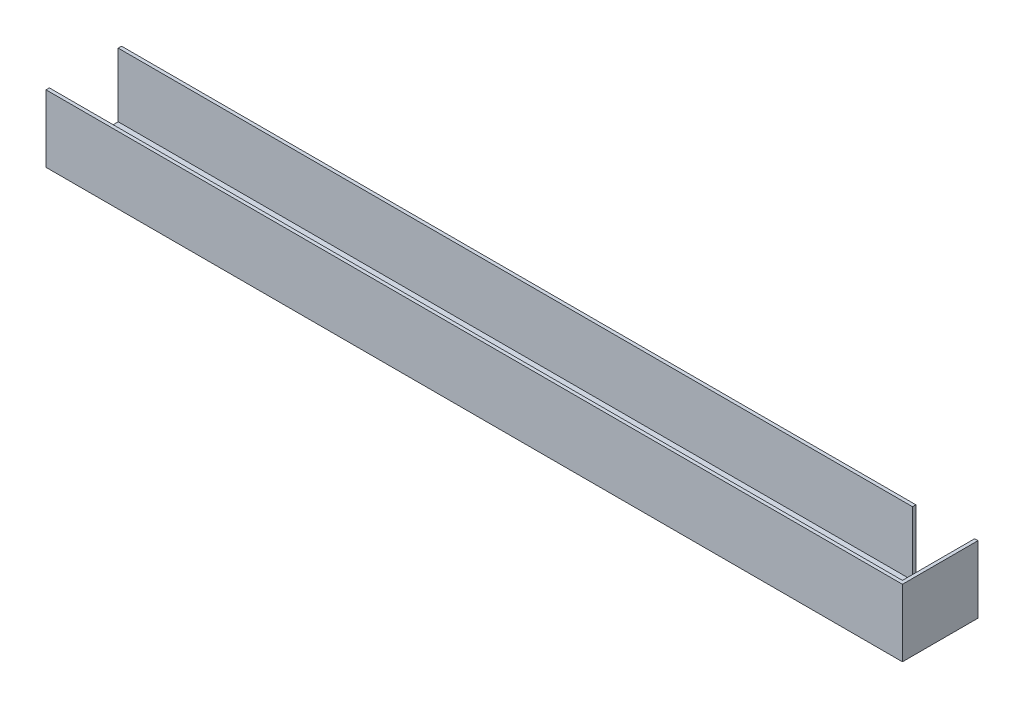
ISO-10303-21;
HEADER;
FILE_DESCRIPTION(('STEP AP214'),'2;1');
FILE_NAME('part.step','',(''),(''),'','','');
FILE_SCHEMA(('AUTOMOTIVE_DESIGN { 1 0 10303 214 1 1 1 1 }'));
ENDSEC;
DATA;
#1=APPLICATION_CONTEXT('core data for automotive mechanical design processes');
#2=APPLICATION_PROTOCOL_DEFINITION('international standard','automotive_design',2000,#1);
#3=PRODUCT_CONTEXT('',#1,'mechanical');
#4=PRODUCT('Part','Part','',(#3));
#5=PRODUCT_RELATED_PRODUCT_CATEGORY('part','',(#4));
#6=PRODUCT_DEFINITION_FORMATION('','',#4);
#7=PRODUCT_DEFINITION_CONTEXT('part definition',#1,'design');
#8=PRODUCT_DEFINITION('design','',#6,#7);
#9=PRODUCT_DEFINITION_SHAPE('','',#8);
#10=(LENGTH_UNIT() NAMED_UNIT(*) SI_UNIT(.MILLI.,.METRE.));
#11=(NAMED_UNIT(*) PLANE_ANGLE_UNIT() SI_UNIT($,.RADIAN.));
#12=(NAMED_UNIT(*) SI_UNIT($,.STERADIAN.) SOLID_ANGLE_UNIT());
#13=UNCERTAINTY_MEASURE_WITH_UNIT(LENGTH_MEASURE(1.E-05),#10,'distance_accuracy_value','');
#14=(GEOMETRIC_REPRESENTATION_CONTEXT(3) GLOBAL_UNCERTAINTY_ASSIGNED_CONTEXT((#13)) GLOBAL_UNIT_ASSIGNED_CONTEXT((#10,
#11,#12)) REPRESENTATION_CONTEXT('',''));
#15=CARTESIAN_POINT('',(0.,0.,0.));
#16=DIRECTION('',(0.,0.,1.));
#17=DIRECTION('',(1.,0.,0.));
#18=AXIS2_PLACEMENT_3D('',#15,#16,#17);
#19=CARTESIAN_POINT('',(-647.7,101.6,-114.3));
#20=DIRECTION('',(0.,1.,0.));
#21=DIRECTION('',(-1.,0.,0.));
#22=AXIS2_PLACEMENT_3D('',#19,#20,#21);
#23=PLANE('',#22);
#24=DIRECTION('',(0.,0.,-1.));
#25=VECTOR('',#24,1.);
#26=CARTESIAN_POINT('',(553.72,101.6,22.0024081473894));
#27=LINE('',#26,#25);
#28=CARTESIAN_POINT('',(553.72,101.6,-109.22));
#29=VERTEX_POINT('',#28);
#30=CARTESIAN_POINT('',(553.72,101.6,-114.3));
#31=VERTEX_POINT('',#30);
#32=EDGE_CURVE('E134',#29,#31,#27,.T.);
#33=ORIENTED_EDGE('',*,*,#32,.T.);
#34=DIRECTION('',(-1.,0.,0.));
#35=VECTOR('',#34,1.);
#36=CARTESIAN_POINT('',(-647.7,101.6,-114.3));
#37=LINE('',#36,#35);
#38=CARTESIAN_POINT('',(-647.7,101.6,-114.3));
#39=VERTEX_POINT('',#38);
#40=EDGE_CURVE('E186',#31,#39,#37,.T.);
#41=ORIENTED_EDGE('',*,*,#40,.T.);
#42=DIRECTION('',(0.,0.,1.));
#43=VECTOR('',#42,1.);
#44=CARTESIAN_POINT('',(-647.7,101.6,-114.3));
#45=LINE('',#44,#43);
#46=CARTESIAN_POINT('',(-647.7,101.6,-109.22));
#47=VERTEX_POINT('',#46);
#48=EDGE_CURVE('E212',#39,#47,#45,.T.);
#49=ORIENTED_EDGE('',*,*,#48,.T.);
#50=DIRECTION('',(-1.,0.,0.));
#51=VECTOR('',#50,1.);
#52=CARTESIAN_POINT('',(0.,101.6,-109.22));
#53=LINE('',#52,#51);
#54=EDGE_CURVE('E163',#29,#47,#53,.T.);
#55=ORIENTED_EDGE('',*,*,#54,.F.);
#56=EDGE_LOOP('',(#33,#41,#49,#55));
#57=FACE_BOUND('',#56,.T.);
#58=ADVANCED_FACE('F43',(#57),#23,.T.);
#59=CARTESIAN_POINT('',(-647.7,0.,-114.3));
#60=DIRECTION('',(-1.,0.,0.));
#61=DIRECTION('',(0.,0.,1.));
#62=AXIS2_PLACEMENT_3D('',#59,#60,#61);
#63=PLANE('',#62);
#64=CARTESIAN_POINT('',(-647.7,101.6,-5.08));
#65=VERTEX_POINT('',#64);
#66=CARTESIAN_POINT('',(-647.7,101.6,0.));
#67=VERTEX_POINT('',#66);
#68=EDGE_CURVE('E215',#65,#67,#45,.T.);
#69=ORIENTED_EDGE('',*,*,#68,.F.);
#70=DIRECTION('',(0.,-1.,0.));
#71=VECTOR('',#70,1.);
#72=CARTESIAN_POINT('',(-647.7,0.,-5.08));
#73=LINE('',#72,#71);
#74=CARTESIAN_POINT('',(-647.7,5.08,-5.08));
#75=VERTEX_POINT('',#74);
#76=EDGE_CURVE('E174',#65,#75,#73,.T.);
#77=ORIENTED_EDGE('',*,*,#76,.T.);
#78=DIRECTION('',(0.,0.,1.));
#79=VECTOR('',#78,1.);
#80=CARTESIAN_POINT('',(-647.7,5.08,-114.3));
#81=LINE('',#80,#79);
#82=CARTESIAN_POINT('',(-647.7,5.08,-109.22));
#83=VERTEX_POINT('',#82);
#84=EDGE_CURVE('E161',#83,#75,#81,.T.);
#85=ORIENTED_EDGE('',*,*,#84,.F.);
#86=DIRECTION('',(0.,-1.,0.));
#87=VECTOR('',#86,1.);
#88=CARTESIAN_POINT('',(-647.7,0.,-109.22));
#89=LINE('',#88,#87);
#90=EDGE_CURVE('E154',#47,#83,#89,.T.);
#91=ORIENTED_EDGE('',*,*,#90,.F.);
#92=ORIENTED_EDGE('',*,*,#48,.F.);
#93=DIRECTION('',(0.,-1.,0.));
#94=VECTOR('',#93,1.);
#95=CARTESIAN_POINT('',(-647.7,0.,-114.3));
#96=LINE('',#95,#94);
#97=CARTESIAN_POINT('',(-647.7,0.,-114.3));
#98=VERTEX_POINT('',#97);
#99=EDGE_CURVE('E191',#39,#98,#96,.T.);
#100=ORIENTED_EDGE('',*,*,#99,.T.);
#101=DIRECTION('',(0.,0.,1.));
#102=VECTOR('',#101,1.);
#103=CARTESIAN_POINT('',(-647.7,0.,-114.3));
#104=LINE('',#103,#102);
#105=CARTESIAN_POINT('',(-647.7,0.,0.));
#106=VERTEX_POINT('',#105);
#107=EDGE_CURVE('E54',#98,#106,#104,.T.);
#108=ORIENTED_EDGE('',*,*,#107,.T.);
#109=DIRECTION('',(0.,-1.,0.));
#110=VECTOR('',#109,1.);
#111=CARTESIAN_POINT('',(-647.7,0.,0.));
#112=LINE('',#111,#110);
#113=EDGE_CURVE('E205',#67,#106,#112,.T.);
#114=ORIENTED_EDGE('',*,*,#113,.F.);
#115=EDGE_LOOP('',(#69,#77,#85,#91,#92,#100,#108,#114));
#116=FACE_BOUND('',#115,.T.);
#117=ADVANCED_FACE('F227',(#116),#63,.T.);
#118=CARTESIAN_POINT('',(647.7,101.6,-114.3));
#119=VERTEX_POINT('',#118);
#120=CARTESIAN_POINT('',(642.62,101.6,-114.3));
#121=VERTEX_POINT('',#120);
#122=EDGE_CURVE('E188',#119,#121,#37,.T.);
#123=ORIENTED_EDGE('',*,*,#122,.T.);
#124=DIRECTION('',(0.,0.,1.));
#125=VECTOR('',#124,1.);
#126=CARTESIAN_POINT('',(642.62,101.6,-114.3));
#127=LINE('',#126,#125);
#128=CARTESIAN_POINT('',(642.62,101.6,-5.08));
#129=VERTEX_POINT('',#128);
#130=EDGE_CURVE('E156',#121,#129,#127,.T.);
#131=ORIENTED_EDGE('',*,*,#130,.T.);
#132=DIRECTION('',(-1.,0.,0.));
#133=VECTOR('',#132,1.);
#134=CARTESIAN_POINT('',(0.,101.6,-5.08));
#135=LINE('',#134,#133);
#136=EDGE_CURVE('E178',#129,#65,#135,.T.);
#137=ORIENTED_EDGE('',*,*,#136,.T.);
#138=ORIENTED_EDGE('',*,*,#68,.T.);
#139=DIRECTION('',(-1.,0.,0.));
#140=VECTOR('',#139,1.);
#141=CARTESIAN_POINT('',(-647.7,101.6,0.));
#142=LINE('',#141,#140);
#143=CARTESIAN_POINT('',(647.7,101.6,0.));
#144=VERTEX_POINT('',#143);
#145=EDGE_CURVE('E201',#144,#67,#142,.T.);
#146=ORIENTED_EDGE('',*,*,#145,.F.);
#147=DIRECTION('',(0.,0.,1.));
#148=VECTOR('',#147,1.);
#149=CARTESIAN_POINT('',(647.7,101.6,-114.3));
#150=LINE('',#149,#148);
#151=EDGE_CURVE('E47',#119,#144,#150,.T.);
#152=ORIENTED_EDGE('',*,*,#151,.F.);
#153=EDGE_LOOP('',(#123,#131,#137,#138,#146,#152));
#154=FACE_BOUND('',#153,.T.);
#155=ADVANCED_FACE('F221',(#154),#23,.T.);
#156=CARTESIAN_POINT('',(647.7,101.6,-114.3));
#157=DIRECTION('',(1.,0.,0.));
#158=DIRECTION('',(0.,0.,-1.));
#159=AXIS2_PLACEMENT_3D('',#156,#157,#158);
#160=PLANE('',#159);
#161=DIRECTION('',(0.,1.,0.));
#162=VECTOR('',#161,1.);
#163=CARTESIAN_POINT('',(647.7,101.6,0.));
#164=LINE('',#163,#162);
#165=CARTESIAN_POINT('',(647.7,0.,0.));
#166=VERTEX_POINT('',#165);
#167=EDGE_CURVE('E197',#166,#144,#164,.T.);
#168=ORIENTED_EDGE('',*,*,#167,.F.);
#169=DIRECTION('',(0.,0.,1.));
#170=VECTOR('',#169,1.);
#171=CARTESIAN_POINT('',(647.7,0.,-114.3));
#172=LINE('',#171,#170);
#173=CARTESIAN_POINT('',(647.7,0.,-114.3));
#174=VERTEX_POINT('',#173);
#175=EDGE_CURVE('E11',#174,#166,#172,.T.);
#176=ORIENTED_EDGE('',*,*,#175,.F.);
#177=DIRECTION('',(0.,1.,0.));
#178=VECTOR('',#177,1.);
#179=CARTESIAN_POINT('',(647.7,101.6,-114.3));
#180=LINE('',#179,#178);
#181=EDGE_CURVE('E183',#174,#119,#180,.T.);
#182=ORIENTED_EDGE('',*,*,#181,.T.);
#183=ORIENTED_EDGE('',*,*,#151,.T.);
#184=EDGE_LOOP('',(#168,#176,#182,#183));
#185=FACE_BOUND('',#184,.T.);
#186=ADVANCED_FACE('F45',(#185),#160,.T.);
#187=CARTESIAN_POINT('',(-647.7,0.,-114.3));
#188=DIRECTION('',(0.,-1.,0.));
#189=DIRECTION('',(0.,0.,-1.));
#190=AXIS2_PLACEMENT_3D('',#187,#188,#189);
#191=PLANE('',#190);
#192=DIRECTION('',(1.,0.,0.));
#193=VECTOR('',#192,1.);
#194=CARTESIAN_POINT('',(-647.7,0.,0.));
#195=LINE('',#194,#193);
#196=EDGE_CURVE('E187',#106,#166,#195,.T.);
#197=ORIENTED_EDGE('',*,*,#196,.F.);
#198=ORIENTED_EDGE('',*,*,#107,.F.);
#199=DIRECTION('',(1.,0.,0.));
#200=VECTOR('',#199,1.);
#201=CARTESIAN_POINT('',(-647.7,0.,-114.3));
#202=LINE('',#201,#200);
#203=EDGE_CURVE('E194',#98,#174,#202,.T.);
#204=ORIENTED_EDGE('',*,*,#203,.T.);
#205=ORIENTED_EDGE('',*,*,#175,.T.);
#206=EDGE_LOOP('',(#197,#198,#204,#205));
#207=FACE_BOUND('',#206,.T.);
#208=ADVANCED_FACE('F224',(#207),#191,.T.);
#209=CARTESIAN_POINT('',(0.,0.,-114.3));
#210=DIRECTION('',(0.,0.,1.));
#211=DIRECTION('',(1.,0.,0.));
#212=AXIS2_PLACEMENT_3D('',#209,#210,#211);
#213=PLANE('',#212);
#214=ORIENTED_EDGE('',*,*,#40,.F.);
#215=DIRECTION('',(0.,1.,0.));
#216=VECTOR('',#215,1.);
#217=CARTESIAN_POINT('',(553.72,5.08,-114.3));
#218=LINE('',#217,#216);
#219=CARTESIAN_POINT('',(553.72,5.08,-114.3));
#220=VERTEX_POINT('',#219);
#221=EDGE_CURVE('E150',#220,#31,#218,.T.);
#222=ORIENTED_EDGE('',*,*,#221,.F.);
#223=DIRECTION('',(-1.,0.,0.));
#224=VECTOR('',#223,1.);
#225=CARTESIAN_POINT('',(642.62,5.08,-114.3));
#226=LINE('',#225,#224);
#227=CARTESIAN_POINT('',(642.62,5.08,-114.3));
#228=VERTEX_POINT('',#227);
#229=EDGE_CURVE('E147',#228,#220,#226,.T.);
#230=ORIENTED_EDGE('',*,*,#229,.F.);
#231=DIRECTION('',(0.,-1.,0.));
#232=VECTOR('',#231,1.);
#233=CARTESIAN_POINT('',(642.62,5.08,-114.3));
#234=LINE('',#233,#232);
#235=EDGE_CURVE('E233',#121,#228,#234,.T.);
#236=ORIENTED_EDGE('',*,*,#235,.F.);
#237=ORIENTED_EDGE('',*,*,#122,.F.);
#238=ORIENTED_EDGE('',*,*,#181,.F.);
#239=ORIENTED_EDGE('',*,*,#203,.F.);
#240=ORIENTED_EDGE('',*,*,#99,.F.);
#241=EDGE_LOOP('',(#214,#222,#230,#236,#237,#238,#239,#240));
#242=FACE_BOUND('',#241,.T.);
#243=ADVANCED_FACE('F230',(#242),#213,.F.);
#244=CARTESIAN_POINT('',(0.,0.,0.));
#245=DIRECTION('',(0.,0.,1.));
#246=DIRECTION('',(1.,0.,0.));
#247=AXIS2_PLACEMENT_3D('',#244,#245,#246);
#248=PLANE('',#247);
#249=ORIENTED_EDGE('',*,*,#167,.T.);
#250=ORIENTED_EDGE('',*,*,#145,.T.);
#251=ORIENTED_EDGE('',*,*,#113,.T.);
#252=ORIENTED_EDGE('',*,*,#196,.T.);
#253=EDGE_LOOP('',(#249,#250,#251,#252));
#254=FACE_BOUND('',#253,.T.);
#255=ADVANCED_FACE('F223',(#254),#248,.T.);
#256=CARTESIAN_POINT('',(642.62,101.6,-114.3));
#257=DIRECTION('',(1.,0.,0.));
#258=DIRECTION('',(0.,0.,-1.));
#259=AXIS2_PLACEMENT_3D('',#256,#257,#258);
#260=PLANE('',#259);
#261=DIRECTION('',(0.,1.,0.));
#262=VECTOR('',#261,1.);
#263=CARTESIAN_POINT('',(642.62,0.,-5.08));
#264=LINE('',#263,#262);
#265=CARTESIAN_POINT('',(642.62,5.08,-5.08));
#266=VERTEX_POINT('',#265);
#267=EDGE_CURVE('E182',#266,#129,#264,.T.);
#268=ORIENTED_EDGE('',*,*,#267,.T.);
#269=ORIENTED_EDGE('',*,*,#130,.F.);
#270=ORIENTED_EDGE('',*,*,#235,.T.);
#271=DIRECTION('',(0.,0.,1.));
#272=VECTOR('',#271,1.);
#273=CARTESIAN_POINT('',(642.62,5.08,-114.3));
#274=LINE('',#273,#272);
#275=EDGE_CURVE('E173',#228,#266,#274,.T.);
#276=ORIENTED_EDGE('',*,*,#275,.T.);
#277=EDGE_LOOP('',(#268,#269,#270,#276));
#278=FACE_BOUND('',#277,.T.);
#279=ADVANCED_FACE('F236',(#278),#260,.F.);
#280=CARTESIAN_POINT('',(-647.7,5.08,-114.3));
#281=DIRECTION('',(0.,-1.,0.));
#282=DIRECTION('',(0.,0.,-1.));
#283=AXIS2_PLACEMENT_3D('',#280,#281,#282);
#284=PLANE('',#283);
#285=DIRECTION('',(1.,0.,0.));
#286=VECTOR('',#285,1.);
#287=CARTESIAN_POINT('',(0.,5.08,-5.08));
#288=LINE('',#287,#286);
#289=EDGE_CURVE('E166',#75,#266,#288,.T.);
#290=ORIENTED_EDGE('',*,*,#289,.T.);
#291=ORIENTED_EDGE('',*,*,#275,.F.);
#292=ORIENTED_EDGE('',*,*,#229,.T.);
#293=DIRECTION('',(0.,0.,-1.));
#294=VECTOR('',#293,1.);
#295=CARTESIAN_POINT('',(553.72,5.08,22.0024081473894));
#296=LINE('',#295,#294);
#297=CARTESIAN_POINT('',(553.72,5.08,-109.22));
#298=VERTEX_POINT('',#297);
#299=EDGE_CURVE('E131',#298,#220,#296,.T.);
#300=ORIENTED_EDGE('',*,*,#299,.F.);
#301=DIRECTION('',(1.,0.,0.));
#302=VECTOR('',#301,1.);
#303=CARTESIAN_POINT('',(0.,5.08,-109.22));
#304=LINE('',#303,#302);
#305=EDGE_CURVE('E144',#83,#298,#304,.T.);
#306=ORIENTED_EDGE('',*,*,#305,.F.);
#307=ORIENTED_EDGE('',*,*,#84,.T.);
#308=EDGE_LOOP('',(#290,#291,#292,#300,#306,#307));
#309=FACE_BOUND('',#308,.T.);
#310=ADVANCED_FACE('F143',(#309),#284,.F.);
#311=CARTESIAN_POINT('',(0.,0.,-109.22));
#312=DIRECTION('',(0.,0.,1.));
#313=DIRECTION('',(1.,0.,0.));
#314=AXIS2_PLACEMENT_3D('',#311,#312,#313);
#315=PLANE('',#314);
#316=DIRECTION('',(0.,1.,0.));
#317=VECTOR('',#316,1.);
#318=CARTESIAN_POINT('',(553.72,5.08,-109.22));
#319=LINE('',#318,#317);
#320=EDGE_CURVE('E128',#298,#29,#319,.T.);
#321=ORIENTED_EDGE('',*,*,#320,.T.);
#322=ORIENTED_EDGE('',*,*,#54,.T.);
#323=ORIENTED_EDGE('',*,*,#90,.T.);
#324=ORIENTED_EDGE('',*,*,#305,.T.);
#325=EDGE_LOOP('',(#321,#322,#323,#324));
#326=FACE_BOUND('',#325,.T.);
#327=ADVANCED_FACE('F152',(#326),#315,.T.);
#328=CARTESIAN_POINT('',(0.,0.,-5.08));
#329=DIRECTION('',(0.,0.,1.));
#330=DIRECTION('',(1.,0.,0.));
#331=AXIS2_PLACEMENT_3D('',#328,#329,#330);
#332=PLANE('',#331);
#333=ORIENTED_EDGE('',*,*,#267,.F.);
#334=ORIENTED_EDGE('',*,*,#289,.F.);
#335=ORIENTED_EDGE('',*,*,#76,.F.);
#336=ORIENTED_EDGE('',*,*,#136,.F.);
#337=EDGE_LOOP('',(#333,#334,#335,#336));
#338=FACE_BOUND('',#337,.T.);
#339=ADVANCED_FACE('F252',(#338),#332,.F.);
#340=CARTESIAN_POINT('',(553.72,5.08,22.0024081473894));
#341=DIRECTION('',(-1.,0.,0.));
#342=DIRECTION('',(0.,0.,1.));
#343=AXIS2_PLACEMENT_3D('',#340,#341,#342);
#344=PLANE('',#343);
#345=ORIENTED_EDGE('',*,*,#299,.T.);
#346=ORIENTED_EDGE('',*,*,#221,.T.);
#347=ORIENTED_EDGE('',*,*,#32,.F.);
#348=ORIENTED_EDGE('',*,*,#320,.F.);
#349=EDGE_LOOP('',(#345,#346,#347,#348));
#350=FACE_BOUND('',#349,.T.);
#351=ADVANCED_FACE('F130',(#350),#344,.F.);
#352=CLOSED_SHELL('',(#58,#117,#155,#186,#208,#243,#255,#279,#310,#327,#339,#351));
#353=MANIFOLD_SOLID_BREP('B2',#352);
#354=ADVANCED_BREP_SHAPE_REPRESENTATION('',(#18,#353),#14);
#355=SHAPE_DEFINITION_REPRESENTATION(#9,#354);
ENDSEC;
END-ISO-10303-21;
